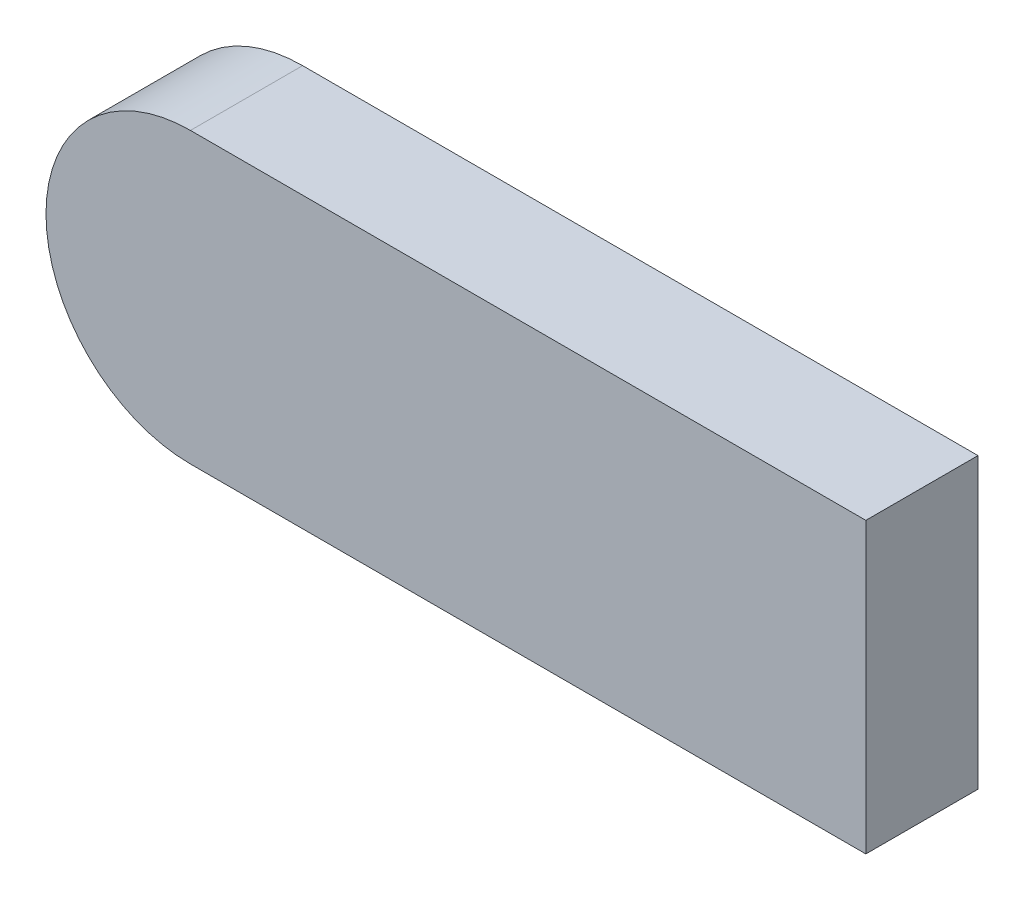
ISO-10303-21;
HEADER;
FILE_DESCRIPTION(('STEP AP214'),'2;1');
FILE_NAME('part.step','',(''),(''),'','','');
FILE_SCHEMA(('AUTOMOTIVE_DESIGN { 1 0 10303 214 1 1 1 1 }'));
ENDSEC;
DATA;
#1=APPLICATION_CONTEXT('core data for automotive mechanical design processes');
#2=APPLICATION_PROTOCOL_DEFINITION('international standard','automotive_design',2000,#1);
#3=PRODUCT_CONTEXT('',#1,'mechanical');
#4=PRODUCT('Part','Part','',(#3));
#5=PRODUCT_RELATED_PRODUCT_CATEGORY('part','',(#4));
#6=PRODUCT_DEFINITION_FORMATION('','',#4);
#7=PRODUCT_DEFINITION_CONTEXT('part definition',#1,'design');
#8=PRODUCT_DEFINITION('design','',#6,#7);
#9=PRODUCT_DEFINITION_SHAPE('','',#8);
#10=(LENGTH_UNIT() NAMED_UNIT(*) SI_UNIT(.MILLI.,.METRE.));
#11=(NAMED_UNIT(*) PLANE_ANGLE_UNIT() SI_UNIT($,.RADIAN.));
#12=(NAMED_UNIT(*) SI_UNIT($,.STERADIAN.) SOLID_ANGLE_UNIT());
#13=UNCERTAINTY_MEASURE_WITH_UNIT(LENGTH_MEASURE(1.E-05),#10,'distance_accuracy_value','');
#14=(GEOMETRIC_REPRESENTATION_CONTEXT(3) GLOBAL_UNCERTAINTY_ASSIGNED_CONTEXT((#13)) GLOBAL_UNIT_ASSIGNED_CONTEXT((#10,
#11,#12)) REPRESENTATION_CONTEXT('',''));
#15=CARTESIAN_POINT('',(0.,0.,0.));
#16=DIRECTION('',(0.,0.,1.));
#17=DIRECTION('',(1.,0.,0.));
#18=AXIS2_PLACEMENT_3D('',#15,#16,#17);
#19=CARTESIAN_POINT('',(-12.3042138671329,-1.03740541843096,-11.6632275560423));
#20=DIRECTION('',(0.,0.,1.));
#21=DIRECTION('',(0.,-1.,0.));
#22=AXIS2_PLACEMENT_3D('',#19,#20,#21);
#23=PLANE('',#22);
#24=CARTESIAN_POINT('',(3.71650767223854,-2.16962409492803,-11.6632275560423));
#25=DIRECTION('',(0.,0.,1.));
#26=DIRECTION('',(0.,-1.,0.));
#27=AXIS2_PLACEMENT_3D('',#24,#25,#26);
#28=CIRCLE('',#27,0.0669742917998595);
#29=CARTESIAN_POINT('',(3.71650767223852,-2.1026498031281,-11.6632275560423));
#30=VERTEX_POINT('',#29);
#31=CARTESIAN_POINT('',(3.71650767223853,-2.23659838672803,-11.6632275560423));
#32=VERTEX_POINT('',#31);
#33=EDGE_CURVE('E19',#30,#32,#28,.T.);
#34=ORIENTED_EDGE('',*,*,#33,.F.);
#35=DIRECTION('',(1.,0.,0.));
#36=VECTOR('',#35,1.);
#37=CARTESIAN_POINT('',(4.02960506983851,-2.1026498031281,-11.6632275560423));
#38=LINE('',#37,#36);
#39=CARTESIAN_POINT('',(4.02960506983851,-2.1026498031281,-11.6632275560423));
#40=VERTEX_POINT('',#39);
#41=EDGE_CURVE('E57',#40,#30,#38,.F.);
#42=ORIENTED_EDGE('',*,*,#41,.F.);
#43=DIRECTION('',(0.,1.,0.));
#44=VECTOR('',#43,1.);
#45=CARTESIAN_POINT('',(4.02960506983852,-2.23659838672809,-11.6632275560423));
#46=LINE('',#45,#44);
#47=CARTESIAN_POINT('',(4.02960506983852,-2.23659838672809,-11.6632275560423));
#48=VERTEX_POINT('',#47);
#49=EDGE_CURVE('E73',#48,#40,#46,.T.);
#50=ORIENTED_EDGE('',*,*,#49,.F.);
#51=DIRECTION('',(1.,-1.84600256939438E-13,0.));
#52=VECTOR('',#51,1.);
#53=CARTESIAN_POINT('',(4.02960506983852,-2.23659838672809,-11.6632275560423));
#54=LINE('',#53,#52);
#55=EDGE_CURVE('E59',#32,#48,#54,.T.);
#56=ORIENTED_EDGE('',*,*,#55,.F.);
#57=EDGE_LOOP('',(#34,#42,#50,#56));
#58=FACE_BOUND('',#57,.T.);
#59=ADVANCED_FACE('F16',(#58),#23,.F.);
#60=CARTESIAN_POINT('',(3.71650767223854,-2.16962409492803,-11.6112275560423));
#61=DIRECTION('',(0.,0.,1.));
#62=DIRECTION('',(0.,-1.,0.));
#63=AXIS2_PLACEMENT_3D('',#60,#61,#62);
#64=CYLINDRICAL_SURFACE('',#63,0.0669742917998595);
#65=ORIENTED_EDGE('',*,*,#33,.T.);
#66=DIRECTION('',(0.,0.,1.));
#67=VECTOR('',#66,1.);
#68=CARTESIAN_POINT('',(3.71650767223854,-2.23659838672803,-11.6112275560423));
#69=LINE('',#68,#67);
#70=CARTESIAN_POINT('',(3.71650767223854,-2.23659838672797,-11.6112275560423));
#71=VERTEX_POINT('',#70);
#72=EDGE_CURVE('E82',#71,#32,#69,.F.);
#73=ORIENTED_EDGE('',*,*,#72,.F.);
#74=CARTESIAN_POINT('',(3.71650767223854,-2.16962409492803,-11.6112275560423));
#75=DIRECTION('',(0.,0.,1.));
#76=DIRECTION('',(0.,-1.,0.));
#77=AXIS2_PLACEMENT_3D('',#74,#75,#76);
#78=CIRCLE('',#77,0.0669742917998595);
#79=CARTESIAN_POINT('',(3.71650767223852,-2.1026498031281,-11.6112275560423));
#80=VERTEX_POINT('',#79);
#81=EDGE_CURVE('E66',#80,#71,#78,.T.);
#82=ORIENTED_EDGE('',*,*,#81,.F.);
#83=DIRECTION('',(0.,0.,1.));
#84=VECTOR('',#83,1.);
#85=CARTESIAN_POINT('',(3.71650767223851,-2.1026498031281,-11.6112275560423));
#86=LINE('',#85,#84);
#87=EDGE_CURVE('E63',#30,#80,#86,.T.);
#88=ORIENTED_EDGE('',*,*,#87,.F.);
#89=EDGE_LOOP('',(#65,#73,#82,#88));
#90=FACE_BOUND('',#89,.T.);
#91=ADVANCED_FACE('F64',(#90),#64,.T.);
#92=CARTESIAN_POINT('',(4.02960506983852,-2.23659838672809,-11.6112275560423));
#93=DIRECTION('',(-1.84600256939438E-13,-1.,0.));
#94=DIRECTION('',(1.,-1.84600256939438E-13,0.));
#95=AXIS2_PLACEMENT_3D('',#92,#93,#94);
#96=PLANE('',#95);
#97=DIRECTION('',(1.,0.,0.));
#98=VECTOR('',#97,1.);
#99=CARTESIAN_POINT('',(-12.3042138671329,-2.2365983867279,-11.6112275560423));
#100=LINE('',#99,#98);
#101=CARTESIAN_POINT('',(4.02960506983852,-2.23659838672796,-11.6112275560423));
#102=VERTEX_POINT('',#101);
#103=EDGE_CURVE('E84',#71,#102,#100,.T.);
#104=ORIENTED_EDGE('',*,*,#103,.F.);
#105=ORIENTED_EDGE('',*,*,#72,.T.);
#106=ORIENTED_EDGE('',*,*,#55,.T.);
#107=DIRECTION('',(0.,0.,-1.));
#108=VECTOR('',#107,1.);
#109=CARTESIAN_POINT('',(4.02960506983852,-2.23659838672809,-11.6112275560423));
#110=LINE('',#109,#108);
#111=EDGE_CURVE('E70',#102,#48,#110,.T.);
#112=ORIENTED_EDGE('',*,*,#111,.F.);
#113=EDGE_LOOP('',(#104,#105,#106,#112));
#114=FACE_BOUND('',#113,.T.);
#115=ADVANCED_FACE('F102',(#114),#96,.T.);
#116=CARTESIAN_POINT('',(4.02960506983852,-2.23659838672809,-11.6112275560423));
#117=DIRECTION('',(1.,0.,0.));
#118=DIRECTION('',(0.,0.,-1.));
#119=AXIS2_PLACEMENT_3D('',#116,#117,#118);
#120=PLANE('',#119);
#121=DIRECTION('',(0.,-1.,0.));
#122=VECTOR('',#121,1.);
#123=CARTESIAN_POINT('',(4.02960506983852,-1.03740541843096,-11.6112275560423));
#124=LINE('',#123,#122);
#125=CARTESIAN_POINT('',(4.02960506983852,-2.1026498031281,-11.6112275560423));
#126=VERTEX_POINT('',#125);
#127=EDGE_CURVE('E25',#102,#126,#124,.F.);
#128=ORIENTED_EDGE('',*,*,#127,.F.);
#129=ORIENTED_EDGE('',*,*,#111,.T.);
#130=ORIENTED_EDGE('',*,*,#49,.T.);
#131=DIRECTION('',(0.,0.,1.));
#132=VECTOR('',#131,1.);
#133=CARTESIAN_POINT('',(4.02960506983851,-2.1026498031281,-11.6112275560423));
#134=LINE('',#133,#132);
#135=EDGE_CURVE('E34',#126,#40,#134,.F.);
#136=ORIENTED_EDGE('',*,*,#135,.F.);
#137=EDGE_LOOP('',(#128,#129,#130,#136));
#138=FACE_BOUND('',#137,.T.);
#139=ADVANCED_FACE('F99',(#138),#120,.T.);
#140=CARTESIAN_POINT('',(4.02960506983851,-2.1026498031281,-11.6112275560423));
#141=DIRECTION('',(0.,1.,0.));
#142=DIRECTION('',(0.,0.,1.));
#143=AXIS2_PLACEMENT_3D('',#140,#141,#142);
#144=PLANE('',#143);
#145=DIRECTION('',(1.,0.,0.));
#146=VECTOR('',#145,1.);
#147=CARTESIAN_POINT('',(-12.3042138671329,-2.1026498031281,-11.6112275560423));
#148=LINE('',#147,#146);
#149=EDGE_CURVE('E11',#126,#80,#148,.F.);
#150=ORIENTED_EDGE('',*,*,#149,.F.);
#151=ORIENTED_EDGE('',*,*,#135,.T.);
#152=ORIENTED_EDGE('',*,*,#41,.T.);
#153=ORIENTED_EDGE('',*,*,#87,.T.);
#154=EDGE_LOOP('',(#150,#151,#152,#153));
#155=FACE_BOUND('',#154,.T.);
#156=ADVANCED_FACE('F69',(#155),#144,.T.);
#157=CARTESIAN_POINT('',(-12.3042138671329,-1.03740541843096,-11.6112275560423));
#158=DIRECTION('',(0.,0.,1.));
#159=DIRECTION('',(0.,-1.,0.));
#160=AXIS2_PLACEMENT_3D('',#157,#158,#159);
#161=PLANE('',#160);
#162=ORIENTED_EDGE('',*,*,#127,.T.);
#163=ORIENTED_EDGE('',*,*,#149,.T.);
#164=ORIENTED_EDGE('',*,*,#81,.T.);
#165=ORIENTED_EDGE('',*,*,#103,.T.);
#166=EDGE_LOOP('',(#162,#163,#164,#165));
#167=FACE_BOUND('',#166,.T.);
#168=ADVANCED_FACE('F103',(#167),#161,.T.);
#169=CLOSED_SHELL('',(#59,#91,#115,#139,#156,#168));
#170=MANIFOLD_SOLID_BREP('B1',#169);
#171=ADVANCED_BREP_SHAPE_REPRESENTATION('',(#18,#170),#14);
#172=SHAPE_DEFINITION_REPRESENTATION(#9,#171);
ENDSEC;
END-ISO-10303-21;
